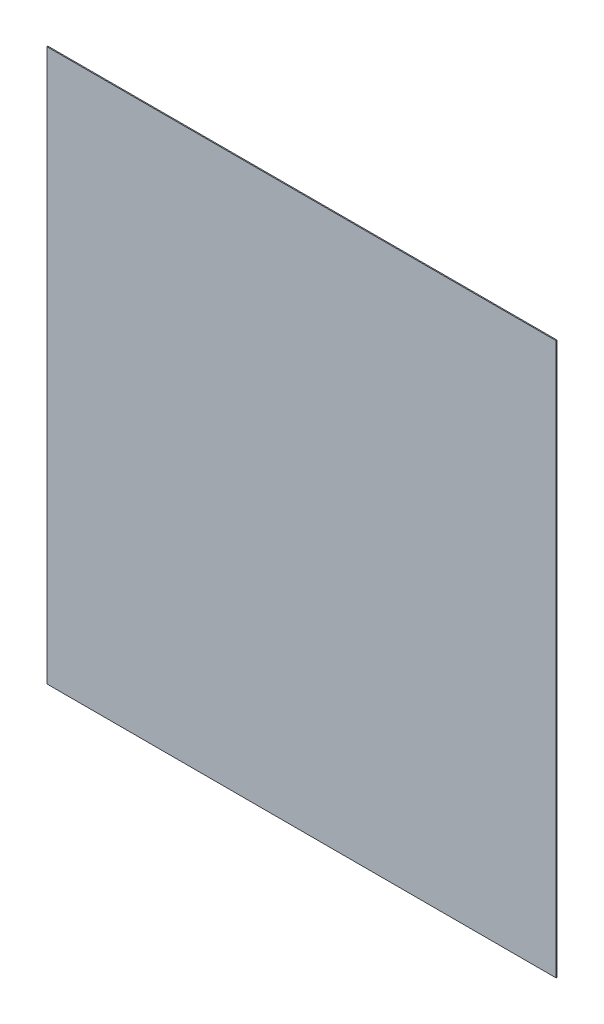
ISO-10303-21;
HEADER;
FILE_DESCRIPTION(('STEP AP214'),'2;1');
FILE_NAME('part.step','',(''),(''),'','','');
FILE_SCHEMA(('AUTOMOTIVE_DESIGN { 1 0 10303 214 1 1 1 1 }'));
ENDSEC;
DATA;
#1=APPLICATION_CONTEXT('core data for automotive mechanical design processes');
#2=APPLICATION_PROTOCOL_DEFINITION('international standard','automotive_design',2000,#1);
#3=PRODUCT_CONTEXT('',#1,'mechanical');
#4=PRODUCT('Part','Part','',(#3));
#5=PRODUCT_RELATED_PRODUCT_CATEGORY('part','',(#4));
#6=PRODUCT_DEFINITION_FORMATION('','',#4);
#7=PRODUCT_DEFINITION_CONTEXT('part definition',#1,'design');
#8=PRODUCT_DEFINITION('design','',#6,#7);
#9=PRODUCT_DEFINITION_SHAPE('','',#8);
#10=(LENGTH_UNIT() NAMED_UNIT(*) SI_UNIT(.MILLI.,.METRE.));
#11=(NAMED_UNIT(*) PLANE_ANGLE_UNIT() SI_UNIT($,.RADIAN.));
#12=(NAMED_UNIT(*) SI_UNIT($,.STERADIAN.) SOLID_ANGLE_UNIT());
#13=UNCERTAINTY_MEASURE_WITH_UNIT(LENGTH_MEASURE(1.E-05),#10,'distance_accuracy_value','');
#14=(GEOMETRIC_REPRESENTATION_CONTEXT(3) GLOBAL_UNCERTAINTY_ASSIGNED_CONTEXT((#13)) GLOBAL_UNIT_ASSIGNED_CONTEXT((#10,
#11,#12)) REPRESENTATION_CONTEXT('',''));
#15=CARTESIAN_POINT('',(0.,0.,0.));
#16=DIRECTION('',(0.,0.,1.));
#17=DIRECTION('',(1.,0.,0.));
#18=AXIS2_PLACEMENT_3D('',#15,#16,#17);
#19=CARTESIAN_POINT('',(-300.,-325.,-1.2));
#20=DIRECTION('',(-1.,0.,0.));
#21=DIRECTION('',(0.,0.,1.));
#22=AXIS2_PLACEMENT_3D('',#19,#20,#21);
#23=PLANE('',#22);
#24=DIRECTION('',(0.,-1.,0.));
#25=VECTOR('',#24,1.);
#26=CARTESIAN_POINT('',(-300.,-325.,0.));
#27=LINE('',#26,#25);
#28=CARTESIAN_POINT('',(-300.,325.,0.));
#29=VERTEX_POINT('',#28);
#30=CARTESIAN_POINT('',(-300.,-325.,0.));
#31=VERTEX_POINT('',#30);
#32=EDGE_CURVE('E107',#29,#31,#27,.T.);
#33=ORIENTED_EDGE('',*,*,#32,.F.);
#34=DIRECTION('',(0.,0.,1.));
#35=VECTOR('',#34,1.);
#36=CARTESIAN_POINT('',(-300.,325.,-1.2));
#37=LINE('',#36,#35);
#38=CARTESIAN_POINT('',(-300.,325.,-1.2));
#39=VERTEX_POINT('',#38);
#40=EDGE_CURVE('E11',#39,#29,#37,.T.);
#41=ORIENTED_EDGE('',*,*,#40,.F.);
#42=DIRECTION('',(0.,-1.,0.));
#43=VECTOR('',#42,1.);
#44=CARTESIAN_POINT('',(-300.,-325.,-1.2));
#45=LINE('',#44,#43);
#46=CARTESIAN_POINT('',(-300.,-325.,-1.2));
#47=VERTEX_POINT('',#46);
#48=EDGE_CURVE('E101',#39,#47,#45,.T.);
#49=ORIENTED_EDGE('',*,*,#48,.T.);
#50=DIRECTION('',(0.,0.,1.));
#51=VECTOR('',#50,1.);
#52=CARTESIAN_POINT('',(-300.,-325.,-1.2));
#53=LINE('',#52,#51);
#54=EDGE_CURVE('E46',#47,#31,#53,.T.);
#55=ORIENTED_EDGE('',*,*,#54,.T.);
#56=EDGE_LOOP('',(#33,#41,#49,#55));
#57=FACE_BOUND('',#56,.T.);
#58=ADVANCED_FACE('F43',(#57),#23,.T.);
#59=CARTESIAN_POINT('',(300.,325.,-1.2));
#60=DIRECTION('',(0.,1.,0.));
#61=DIRECTION('',(-1.,0.,0.));
#62=AXIS2_PLACEMENT_3D('',#59,#60,#61);
#63=PLANE('',#62);
#64=DIRECTION('',(-1.,0.,0.));
#65=VECTOR('',#64,1.);
#66=CARTESIAN_POINT('',(300.,325.,0.));
#67=LINE('',#66,#65);
#68=CARTESIAN_POINT('',(300.,325.,0.));
#69=VERTEX_POINT('',#68);
#70=EDGE_CURVE('E103',#69,#29,#67,.T.);
#71=ORIENTED_EDGE('',*,*,#70,.F.);
#72=DIRECTION('',(0.,0.,1.));
#73=VECTOR('',#72,1.);
#74=CARTESIAN_POINT('',(300.,325.,-1.2));
#75=LINE('',#74,#73);
#76=CARTESIAN_POINT('',(300.,325.,-1.2));
#77=VERTEX_POINT('',#76);
#78=EDGE_CURVE('E52',#77,#69,#75,.T.);
#79=ORIENTED_EDGE('',*,*,#78,.F.);
#80=DIRECTION('',(-1.,0.,0.));
#81=VECTOR('',#80,1.);
#82=CARTESIAN_POINT('',(300.,325.,-1.2));
#83=LINE('',#82,#81);
#84=EDGE_CURVE('E98',#77,#39,#83,.T.);
#85=ORIENTED_EDGE('',*,*,#84,.T.);
#86=ORIENTED_EDGE('',*,*,#40,.T.);
#87=EDGE_LOOP('',(#71,#79,#85,#86));
#88=FACE_BOUND('',#87,.T.);
#89=ADVANCED_FACE('F117',(#88),#63,.T.);
#90=CARTESIAN_POINT('',(300.,-325.,-1.2));
#91=DIRECTION('',(1.,0.,0.));
#92=DIRECTION('',(0.,0.,-1.));
#93=AXIS2_PLACEMENT_3D('',#90,#91,#92);
#94=PLANE('',#93);
#95=DIRECTION('',(0.,1.,0.));
#96=VECTOR('',#95,1.);
#97=CARTESIAN_POINT('',(300.,-325.,0.));
#98=LINE('',#97,#96);
#99=CARTESIAN_POINT('',(300.,-325.,0.));
#100=VERTEX_POINT('',#99);
#101=EDGE_CURVE('E93',#100,#69,#98,.T.);
#102=ORIENTED_EDGE('',*,*,#101,.F.);
#103=DIRECTION('',(0.,0.,1.));
#104=VECTOR('',#103,1.);
#105=CARTESIAN_POINT('',(300.,-325.,-1.2));
#106=LINE('',#105,#104);
#107=CARTESIAN_POINT('',(300.,-325.,-1.2));
#108=VERTEX_POINT('',#107);
#109=EDGE_CURVE('E88',#108,#100,#106,.T.);
#110=ORIENTED_EDGE('',*,*,#109,.F.);
#111=DIRECTION('',(0.,1.,0.));
#112=VECTOR('',#111,1.);
#113=CARTESIAN_POINT('',(300.,-325.,-1.2));
#114=LINE('',#113,#112);
#115=EDGE_CURVE('E91',#108,#77,#114,.T.);
#116=ORIENTED_EDGE('',*,*,#115,.T.);
#117=ORIENTED_EDGE('',*,*,#78,.T.);
#118=EDGE_LOOP('',(#102,#110,#116,#117));
#119=FACE_BOUND('',#118,.T.);
#120=ADVANCED_FACE('F90',(#119),#94,.T.);
#121=CARTESIAN_POINT('',(300.,-325.,-1.2));
#122=DIRECTION('',(0.,-1.,0.));
#123=DIRECTION('',(1.,0.,0.));
#124=AXIS2_PLACEMENT_3D('',#121,#122,#123);
#125=PLANE('',#124);
#126=DIRECTION('',(1.,0.,0.));
#127=VECTOR('',#126,1.);
#128=CARTESIAN_POINT('',(300.,-325.,0.));
#129=LINE('',#128,#127);
#130=EDGE_CURVE('E110',#31,#100,#129,.T.);
#131=ORIENTED_EDGE('',*,*,#130,.F.);
#132=ORIENTED_EDGE('',*,*,#54,.F.);
#133=DIRECTION('',(1.,0.,0.));
#134=VECTOR('',#133,1.);
#135=CARTESIAN_POINT('',(300.,-325.,-1.2));
#136=LINE('',#135,#134);
#137=EDGE_CURVE('E97',#47,#108,#136,.T.);
#138=ORIENTED_EDGE('',*,*,#137,.T.);
#139=ORIENTED_EDGE('',*,*,#109,.T.);
#140=EDGE_LOOP('',(#131,#132,#138,#139));
#141=FACE_BOUND('',#140,.T.);
#142=ADVANCED_FACE('F100',(#141),#125,.T.);
#143=CARTESIAN_POINT('',(0.,0.,-1.2));
#144=DIRECTION('',(0.,0.,1.));
#145=DIRECTION('',(1.,0.,0.));
#146=AXIS2_PLACEMENT_3D('',#143,#144,#145);
#147=PLANE('',#146);
#148=ORIENTED_EDGE('',*,*,#48,.F.);
#149=ORIENTED_EDGE('',*,*,#84,.F.);
#150=ORIENTED_EDGE('',*,*,#115,.F.);
#151=ORIENTED_EDGE('',*,*,#137,.F.);
#152=EDGE_LOOP('',(#148,#149,#150,#151));
#153=FACE_BOUND('',#152,.T.);
#154=ADVANCED_FACE('F96',(#153),#147,.F.);
#155=CARTESIAN_POINT('',(0.,0.,0.));
#156=DIRECTION('',(0.,0.,1.));
#157=DIRECTION('',(1.,0.,0.));
#158=AXIS2_PLACEMENT_3D('',#155,#156,#157);
#159=PLANE('',#158);
#160=ORIENTED_EDGE('',*,*,#32,.T.);
#161=ORIENTED_EDGE('',*,*,#130,.T.);
#162=ORIENTED_EDGE('',*,*,#101,.T.);
#163=ORIENTED_EDGE('',*,*,#70,.T.);
#164=EDGE_LOOP('',(#160,#161,#162,#163));
#165=FACE_BOUND('',#164,.T.);
#166=ADVANCED_FACE('F116',(#165),#159,.T.);
#167=CLOSED_SHELL('',(#58,#89,#120,#142,#154,#166));
#168=MANIFOLD_SOLID_BREP('B2',#167);
#169=ADVANCED_BREP_SHAPE_REPRESENTATION('',(#18,#168),#14);
#170=SHAPE_DEFINITION_REPRESENTATION(#9,#169);
ENDSEC;
END-ISO-10303-21;
